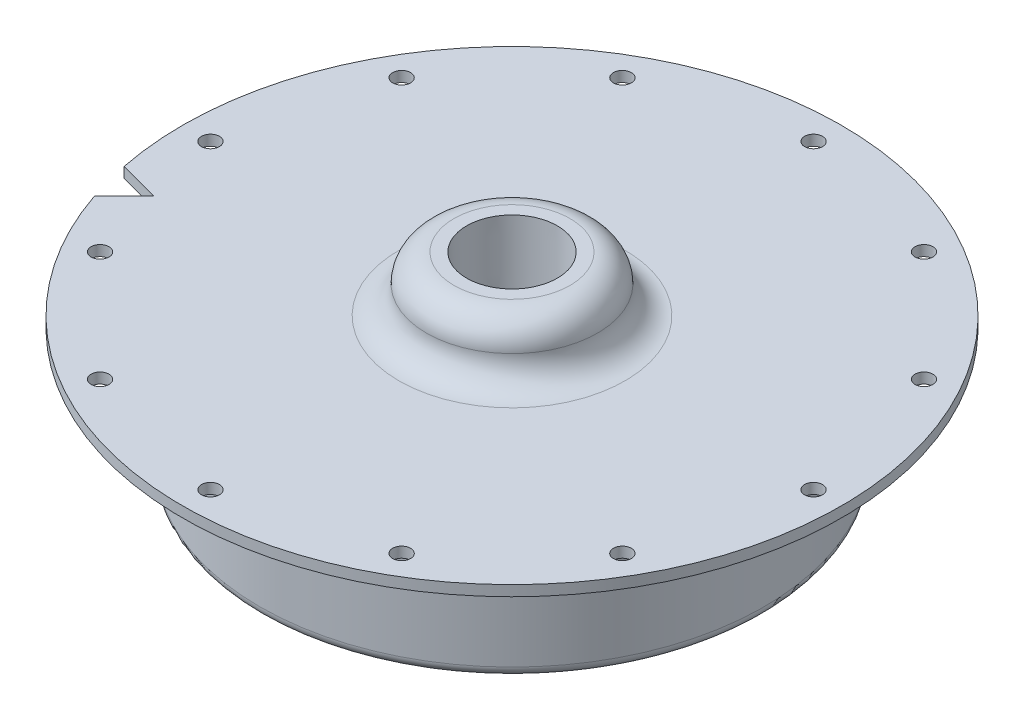
ISO-10303-21;
HEADER;
FILE_DESCRIPTION(('STEP AP214'),'2;1');
FILE_NAME('part.step','',(''),(''),'','','');
FILE_SCHEMA(('AUTOMOTIVE_DESIGN { 1 0 10303 214 1 1 1 1 }'));
ENDSEC;
DATA;
#1=APPLICATION_CONTEXT('core data for automotive mechanical design processes');
#2=APPLICATION_PROTOCOL_DEFINITION('international standard','automotive_design',2000,#1);
#3=PRODUCT_CONTEXT('',#1,'mechanical');
#4=PRODUCT('Part','Part','',(#3));
#5=PRODUCT_RELATED_PRODUCT_CATEGORY('part','',(#4));
#6=PRODUCT_DEFINITION_FORMATION('','',#4);
#7=PRODUCT_DEFINITION_CONTEXT('part definition',#1,'design');
#8=PRODUCT_DEFINITION('design','',#6,#7);
#9=PRODUCT_DEFINITION_SHAPE('','',#8);
#10=(LENGTH_UNIT() NAMED_UNIT(*) SI_UNIT(.MILLI.,.METRE.));
#11=(NAMED_UNIT(*) PLANE_ANGLE_UNIT() SI_UNIT($,.RADIAN.));
#12=(NAMED_UNIT(*) SI_UNIT($,.STERADIAN.) SOLID_ANGLE_UNIT());
#13=UNCERTAINTY_MEASURE_WITH_UNIT(LENGTH_MEASURE(1.E-05),#10,'distance_accuracy_value','');
#14=(GEOMETRIC_REPRESENTATION_CONTEXT(3) GLOBAL_UNCERTAINTY_ASSIGNED_CONTEXT((#13)) GLOBAL_UNIT_ASSIGNED_CONTEXT((#10,
#11,#12)) REPRESENTATION_CONTEXT('',''));
#15=CARTESIAN_POINT('',(0.,0.,0.));
#16=DIRECTION('',(0.,0.,1.));
#17=DIRECTION('',(1.,0.,0.));
#18=AXIS2_PLACEMENT_3D('',#15,#16,#17);
#19=CARTESIAN_POINT('',(0.,55.,0.));
#20=DIRECTION('',(0.,1.,0.));
#21=DIRECTION('',(0.,0.,1.));
#22=AXIS2_PLACEMENT_3D('',#19,#20,#21);
#23=CYLINDRICAL_SURFACE('',#22,49.784);
#24=DIRECTION('',(0.,1.,0.));
#25=VECTOR('',#24,1.);
#26=CARTESIAN_POINT('',(-48.8115083321685,-8.67426131403116,9.79200236614763));
#27=LINE('',#26,#25);
#28=CARTESIAN_POINT('',(-48.8115083321685,0.,9.79200236614763));
#29=VERTEX_POINT('',#28);
#30=CARTESIAN_POINT('',(-48.8115083321685,1.5875,9.79200236614763));
#31=VERTEX_POINT('',#30);
#32=EDGE_CURVE('E66',#29,#31,#27,.T.);
#33=ORIENTED_EDGE('',*,*,#32,.T.);
#34=CARTESIAN_POINT('',(0.,1.5875,0.));
#35=DIRECTION('',(0.,1.,0.));
#36=DIRECTION('',(0.,0.,1.));
#37=AXIS2_PLACEMENT_3D('',#34,#35,#36);
#38=CIRCLE('',#37,49.784);
#39=CARTESIAN_POINT('',(-47.1680073957675,1.5875,15.9256313630832));
#40=VERTEX_POINT('',#39);
#41=EDGE_CURVE('E81',#40,#31,#38,.T.);
#42=ORIENTED_EDGE('',*,*,#41,.F.);
#43=DIRECTION('',(0.,1.,0.));
#44=VECTOR('',#43,1.);
#45=CARTESIAN_POINT('',(-47.1680073957675,-8.67426131403116,15.9256313630832));
#46=LINE('',#45,#44);
#47=CARTESIAN_POINT('',(-47.1680073957675,0.,15.9256313630832));
#48=VERTEX_POINT('',#47);
#49=EDGE_CURVE('E46',#48,#40,#46,.T.);
#50=ORIENTED_EDGE('',*,*,#49,.F.);
#51=CARTESIAN_POINT('',(0.,0.,0.));
#52=DIRECTION('',(0.,1.,0.));
#53=DIRECTION('',(0.,0.,1.));
#54=AXIS2_PLACEMENT_3D('',#51,#52,#53);
#55=CIRCLE('',#54,49.784);
#56=EDGE_CURVE('E11',#48,#29,#55,.T.);
#57=ORIENTED_EDGE('',*,*,#56,.T.);
#58=EDGE_LOOP('',(#33,#42,#50,#57));
#59=FACE_BOUND('',#58,.T.);
#60=ADVANCED_FACE('F32',(#59),#23,.T.);
#61=CARTESIAN_POINT('',(-49.784,0.,0.));
#62=DIRECTION('',(0.,-1.,0.));
#63=DIRECTION('',(0.,0.,-1.));
#64=AXIS2_PLACEMENT_3D('',#61,#62,#63);
#65=PLANE('',#64);
#66=DIRECTION('',(-0.965925826289069,0.,-0.258819045102519));
#67=VECTOR('',#66,1.);
#68=CARTESIAN_POINT('',(-5.71775165127425,0.,21.3389396676165));
#69=LINE('',#68,#67);
#70=CARTESIAN_POINT('',(-42.677879335233,0.,11.4355033025486));
#71=VERTEX_POINT('',#70);
#72=EDGE_CURVE('E64',#71,#29,#69,.T.);
#73=ORIENTED_EDGE('',*,*,#72,.T.);
#74=ORIENTED_EDGE('',*,*,#56,.F.);
#75=DIRECTION('',(0.707106781186548,0.,-0.707106781186547));
#76=VECTOR('',#75,1.);
#77=CARTESIAN_POINT('',(-15.6211880163421,0.,-15.6211880163422));
#78=LINE('',#77,#76);
#79=EDGE_CURVE('E79',#48,#71,#78,.T.);
#80=ORIENTED_EDGE('',*,*,#79,.T.);
#81=EDGE_LOOP('',(#73,#74,#80));
#82=FACE_BOUND('',#81,.T.);
#83=CARTESIAN_POINT('',(-39.4517006668589,0.,-22.7774500000015));
#84=DIRECTION('',(0.,-1.,0.));
#85=DIRECTION('',(0.,0.,-1.));
#86=AXIS2_PLACEMENT_3D('',#83,#84,#85);
#87=CIRCLE('',#86,1.35254999999999);
#88=CARTESIAN_POINT('',(-39.4517006668589,0.,-24.1300000000015));
#89=VERTEX_POINT('',#88);
#90=EDGE_CURVE('E95',#89,#89,#87,.T.);
#91=ORIENTED_EDGE('',*,*,#90,.F.);
#92=EDGE_LOOP('',(#91));
#93=FACE_BOUND('',#92,.T.);
#94=CARTESIAN_POINT('',(-22.7774499999985,0.,-39.4517006668606));
#95=DIRECTION('',(0.,-1.,0.));
#96=DIRECTION('',(0.,0.,-1.));
#97=AXIS2_PLACEMENT_3D('',#94,#95,#96);
#98=CIRCLE('',#97,1.35254999999999);
#99=CARTESIAN_POINT('',(-22.7774499999985,0.,-40.8042506668606));
#100=VERTEX_POINT('',#99);
#101=EDGE_CURVE('E101',#100,#100,#98,.T.);
#102=ORIENTED_EDGE('',*,*,#101,.F.);
#103=EDGE_LOOP('',(#102));
#104=FACE_BOUND('',#103,.T.);
#105=CARTESIAN_POINT('',(1.78252687187594E-12,0.,-45.5549));
#106=DIRECTION('',(0.,-1.,0.));
#107=DIRECTION('',(0.,0.,-1.));
#108=AXIS2_PLACEMENT_3D('',#105,#106,#107);
#109=CIRCLE('',#108,1.35254999999999);
#110=CARTESIAN_POINT('',(1.78252687187594E-12,0.,-46.90745));
#111=VERTEX_POINT('',#110);
#112=EDGE_CURVE('E107',#111,#111,#109,.T.);
#113=ORIENTED_EDGE('',*,*,#112,.F.);
#114=EDGE_LOOP('',(#113));
#115=FACE_BOUND('',#114,.T.);
#116=CARTESIAN_POINT('',(22.7774500000016,0.,-39.4517006668588));
#117=DIRECTION('',(0.,-1.,0.));
#118=DIRECTION('',(0.,0.,-1.));
#119=AXIS2_PLACEMENT_3D('',#116,#117,#118);
#120=CIRCLE('',#119,1.35254999999999);
#121=CARTESIAN_POINT('',(22.7774500000016,0.,-40.8042506668588));
#122=VERTEX_POINT('',#121);
#123=EDGE_CURVE('E113',#122,#122,#120,.T.);
#124=ORIENTED_EDGE('',*,*,#123,.F.);
#125=EDGE_LOOP('',(#124));
#126=FACE_BOUND('',#125,.T.);
#127=CARTESIAN_POINT('',(39.4517006668607,0.,-22.7774499999984));
#128=DIRECTION('',(0.,-1.,0.));
#129=DIRECTION('',(0.,0.,-1.));
#130=AXIS2_PLACEMENT_3D('',#127,#128,#129);
#131=CIRCLE('',#130,1.35254999999999);
#132=CARTESIAN_POINT('',(39.4517006668607,0.,-24.1299999999984));
#133=VERTEX_POINT('',#132);
#134=EDGE_CURVE('E119',#133,#133,#131,.T.);
#135=ORIENTED_EDGE('',*,*,#134,.F.);
#136=EDGE_LOOP('',(#135));
#137=FACE_BOUND('',#136,.T.);
#138=CARTESIAN_POINT('',(45.5549,0.,2.26523184822995E-12));
#139=DIRECTION('',(0.,-1.,0.));
#140=DIRECTION('',(0.,0.,-1.));
#141=AXIS2_PLACEMENT_3D('',#138,#139,#140);
#142=CIRCLE('',#141,1.35254999999999);
#143=CARTESIAN_POINT('',(45.5549,0.,-1.35254999999773));
#144=VERTEX_POINT('',#143);
#145=EDGE_CURVE('E125',#144,#144,#142,.T.);
#146=ORIENTED_EDGE('',*,*,#145,.F.);
#147=EDGE_LOOP('',(#146));
#148=FACE_BOUND('',#147,.T.);
#149=CARTESIAN_POINT('',(39.4517006668587,0.,22.7774500000017));
#150=DIRECTION('',(0.,-1.,0.));
#151=DIRECTION('',(0.,0.,-1.));
#152=AXIS2_PLACEMENT_3D('',#149,#150,#151);
#153=CIRCLE('',#152,1.35254999999999);
#154=CARTESIAN_POINT('',(39.4517006668587,0.,21.4249000000017));
#155=VERTEX_POINT('',#154);
#156=EDGE_CURVE('E131',#155,#155,#153,.T.);
#157=ORIENTED_EDGE('',*,*,#156,.F.);
#158=EDGE_LOOP('',(#157));
#159=FACE_BOUND('',#158,.T.);
#160=CARTESIAN_POINT('',(22.7774499999982,0.,39.4517006668608));
#161=DIRECTION('',(0.,-1.,0.));
#162=DIRECTION('',(0.,0.,-1.));
#163=AXIS2_PLACEMENT_3D('',#160,#161,#162);
#164=CIRCLE('',#163,1.35254999999999);
#165=CARTESIAN_POINT('',(22.7774499999982,0.,38.0991506668608));
#166=VERTEX_POINT('',#165);
#167=EDGE_CURVE('E137',#166,#166,#164,.T.);
#168=ORIENTED_EDGE('',*,*,#167,.F.);
#169=EDGE_LOOP('',(#168));
#170=FACE_BOUND('',#169,.T.);
#171=CARTESIAN_POINT('',(-2.1117204916125E-12,0.,45.5549));
#172=DIRECTION('',(0.,-1.,0.));
#173=DIRECTION('',(0.,0.,-1.));
#174=AXIS2_PLACEMENT_3D('',#171,#172,#173);
#175=CIRCLE('',#174,1.35254999999999);
#176=CARTESIAN_POINT('',(-2.1117204916125E-12,0.,44.20235));
#177=VERTEX_POINT('',#176);
#178=EDGE_CURVE('E143',#177,#177,#175,.T.);
#179=ORIENTED_EDGE('',*,*,#178,.F.);
#180=EDGE_LOOP('',(#179));
#181=FACE_BOUND('',#180,.T.);
#182=CARTESIAN_POINT('',(-22.7774500000019,0.,39.4517006668587));
#183=DIRECTION('',(0.,-1.,0.));
#184=DIRECTION('',(0.,0.,-1.));
#185=AXIS2_PLACEMENT_3D('',#182,#183,#184);
#186=CIRCLE('',#185,1.35254999999999);
#187=CARTESIAN_POINT('',(-22.7774500000019,0.,38.0991506668587));
#188=VERTEX_POINT('',#187);
#189=EDGE_CURVE('E149',#188,#188,#186,.T.);
#190=ORIENTED_EDGE('',*,*,#189,.F.);
#191=EDGE_LOOP('',(#190));
#192=FACE_BOUND('',#191,.T.);
#193=CARTESIAN_POINT('',(-39.4517006668608,0.,22.7774499999981));
#194=DIRECTION('',(0.,-1.,0.));
#195=DIRECTION('',(0.,0.,-1.));
#196=AXIS2_PLACEMENT_3D('',#193,#194,#195);
#197=CIRCLE('',#196,1.35254999999999);
#198=CARTESIAN_POINT('',(-39.4517006668608,0.,21.4248999999981));
#199=VERTEX_POINT('',#198);
#200=EDGE_CURVE('E155',#199,#199,#197,.T.);
#201=ORIENTED_EDGE('',*,*,#200,.F.);
#202=EDGE_LOOP('',(#201));
#203=FACE_BOUND('',#202,.T.);
#204=CARTESIAN_POINT('',(-45.5549,0.,-2.26523184822995E-12));
#205=DIRECTION('',(0.,-1.,0.));
#206=DIRECTION('',(0.,0.,-1.));
#207=AXIS2_PLACEMENT_3D('',#204,#205,#206);
#208=CIRCLE('',#207,1.35254999999999);
#209=CARTESIAN_POINT('',(-45.5549,0.,-1.35255000000226));
#210=VERTEX_POINT('',#209);
#211=EDGE_CURVE('E161',#210,#210,#208,.T.);
#212=ORIENTED_EDGE('',*,*,#211,.F.);
#213=EDGE_LOOP('',(#212));
#214=FACE_BOUND('',#213,.T.);
#215=CARTESIAN_POINT('',(0.,0.,0.));
#216=DIRECTION('',(0.,1.,0.));
#217=DIRECTION('',(0.,0.,1.));
#218=AXIS2_PLACEMENT_3D('',#215,#216,#217);
#219=CIRCLE('',#218,39.6874999999754);
#220=CARTESIAN_POINT('',(0.,0.,39.6874999999754));
#221=VERTEX_POINT('',#220);
#222=EDGE_CURVE('E39',#221,#221,#219,.T.);
#223=ORIENTED_EDGE('',*,*,#222,.T.);
#224=EDGE_LOOP('',(#223));
#225=FACE_BOUND('',#224,.T.);
#226=ADVANCED_FACE('F77',(#82,#93,#104,#115,#126,#137,#148,#159,#170,#181,#192,#203,#214,#225),
#65,.T.);
#227=CARTESIAN_POINT('',(0.,-1.5875,0.));
#228=DIRECTION('',(0.,1.,0.));
#229=DIRECTION('',(0.,0.,1.));
#230=AXIS2_PLACEMENT_3D('',#227,#228,#229);
#231=TOROIDAL_SURFACE('',#230,39.6874999999754,1.5875);
#232=CARTESIAN_POINT('',(0.,-1.5875,0.));
#233=DIRECTION('',(0.,1.,0.));
#234=DIRECTION('',(0.,0.,1.));
#235=AXIS2_PLACEMENT_3D('',#232,#233,#234);
#236=CIRCLE('',#235,38.0999999999754);
#237=CARTESIAN_POINT('',(0.,-1.5875,38.0999999999754));
#238=VERTEX_POINT('',#237);
#239=EDGE_CURVE('E186',#238,#238,#236,.T.);
#240=ORIENTED_EDGE('',*,*,#239,.T.);
#241=EDGE_LOOP('',(#240));
#242=FACE_BOUND('',#241,.T.);
#243=ORIENTED_EDGE('',*,*,#222,.F.);
#244=EDGE_LOOP('',(#243));
#245=FACE_BOUND('',#244,.T.);
#246=ADVANCED_FACE('F192',(#242,#245),#231,.F.);
#247=CARTESIAN_POINT('',(0.,55.,0.));
#248=DIRECTION('',(0.,1.,0.));
#249=DIRECTION('',(0.,0.,1.));
#250=AXIS2_PLACEMENT_3D('',#247,#248,#249);
#251=CYLINDRICAL_SURFACE('',#250,38.0999999999754);
#252=CARTESIAN_POINT('',(0.,-17.4625,0.));
#253=DIRECTION('',(0.,1.,0.));
#254=DIRECTION('',(0.,0.,1.));
#255=AXIS2_PLACEMENT_3D('',#252,#253,#254);
#256=CIRCLE('',#255,38.0999999999754);
#257=CARTESIAN_POINT('',(0.,-17.4625,38.0999999999754));
#258=VERTEX_POINT('',#257);
#259=EDGE_CURVE('E183',#258,#258,#256,.T.);
#260=ORIENTED_EDGE('',*,*,#259,.T.);
#261=EDGE_LOOP('',(#260));
#262=FACE_BOUND('',#261,.T.);
#263=ORIENTED_EDGE('',*,*,#239,.F.);
#264=EDGE_LOOP('',(#263));
#265=FACE_BOUND('',#264,.T.);
#266=ADVANCED_FACE('F194',(#262,#265),#251,.T.);
#267=CARTESIAN_POINT('',(0.,-17.4625,0.));
#268=DIRECTION('',(0.,1.,0.));
#269=DIRECTION('',(0.,0.,1.));
#270=AXIS2_PLACEMENT_3D('',#267,#268,#269);
#271=TOROIDAL_SURFACE('',#270,36.5124999999754,1.5875);
#272=CARTESIAN_POINT('',(0.,-17.4625,0.));
#273=DIRECTION('',(0.,1.,0.));
#274=DIRECTION('',(0.,0.,1.));
#275=AXIS2_PLACEMENT_3D('',#272,#273,#274);
#276=CIRCLE('',#275,34.9249999999754);
#277=CARTESIAN_POINT('',(0.,-17.4625,34.9249999999754));
#278=VERTEX_POINT('',#277);
#279=EDGE_CURVE('E180',#278,#278,#276,.T.);
#280=ORIENTED_EDGE('',*,*,#279,.T.);
#281=EDGE_LOOP('',(#280));
#282=FACE_BOUND('',#281,.T.);
#283=ORIENTED_EDGE('',*,*,#259,.F.);
#284=EDGE_LOOP('',(#283));
#285=FACE_BOUND('',#284,.T.);
#286=ADVANCED_FACE('F201',(#282,#285),#271,.T.);
#287=CARTESIAN_POINT('',(0.,55.,0.));
#288=DIRECTION('',(0.,1.,0.));
#289=DIRECTION('',(0.,0.,1.));
#290=AXIS2_PLACEMENT_3D('',#287,#288,#289);
#291=CYLINDRICAL_SURFACE('',#290,34.9249999999754);
#292=CARTESIAN_POINT('',(0.,-3.175,0.));
#293=DIRECTION('',(0.,1.,0.));
#294=DIRECTION('',(0.,0.,1.));
#295=AXIS2_PLACEMENT_3D('',#292,#293,#294);
#296=CIRCLE('',#295,34.9249999999754);
#297=CARTESIAN_POINT('',(0.,-3.175,34.9249999999754));
#298=VERTEX_POINT('',#297);
#299=EDGE_CURVE('E177',#298,#298,#296,.T.);
#300=ORIENTED_EDGE('',*,*,#299,.T.);
#301=EDGE_LOOP('',(#300));
#302=FACE_BOUND('',#301,.T.);
#303=ORIENTED_EDGE('',*,*,#279,.F.);
#304=EDGE_LOOP('',(#303));
#305=FACE_BOUND('',#304,.T.);
#306=ADVANCED_FACE('F319',(#302,#305),#291,.F.);
#307=CARTESIAN_POINT('',(0.,-3.175,0.));
#308=DIRECTION('',(0.,1.,0.));
#309=DIRECTION('',(0.,0.,1.));
#310=AXIS2_PLACEMENT_3D('',#307,#308,#309);
#311=TOROIDAL_SURFACE('',#310,31.7499999999754,3.17499999999999);
#312=CARTESIAN_POINT('',(0.,0.,0.));
#313=DIRECTION('',(0.,1.,0.));
#314=DIRECTION('',(0.,0.,1.));
#315=AXIS2_PLACEMENT_3D('',#312,#313,#314);
#316=CIRCLE('',#315,31.7499999999754);
#317=CARTESIAN_POINT('',(0.,0.,31.7499999999754));
#318=VERTEX_POINT('',#317);
#319=EDGE_CURVE('E174',#318,#318,#316,.T.);
#320=ORIENTED_EDGE('',*,*,#319,.T.);
#321=EDGE_LOOP('',(#320));
#322=FACE_BOUND('',#321,.T.);
#323=ORIENTED_EDGE('',*,*,#299,.F.);
#324=EDGE_LOOP('',(#323));
#325=FACE_BOUND('',#324,.T.);
#326=ADVANCED_FACE('F315',(#322,#325),#311,.F.);
#327=CARTESIAN_POINT('',(-31.7499999999754,0.,0.));
#328=DIRECTION('',(0.,-1.,0.));
#329=DIRECTION('',(0.,0.,-1.));
#330=AXIS2_PLACEMENT_3D('',#327,#328,#329);
#331=PLANE('',#330);
#332=CARTESIAN_POINT('',(0.,0.,0.));
#333=DIRECTION('',(0.,1.,0.));
#334=DIRECTION('',(0.,0.,1.));
#335=AXIS2_PLACEMENT_3D('',#332,#333,#334);
#336=CIRCLE('',#335,6.55798479417671);
#337=CARTESIAN_POINT('',(0.,0.,6.55798479417671));
#338=VERTEX_POINT('',#337);
#339=EDGE_CURVE('E89',#338,#338,#336,.T.);
#340=ORIENTED_EDGE('',*,*,#339,.T.);
#341=EDGE_LOOP('',(#340));
#342=FACE_BOUND('',#341,.T.);
#343=ORIENTED_EDGE('',*,*,#319,.F.);
#344=EDGE_LOOP('',(#343));
#345=FACE_BOUND('',#344,.T.);
#346=ADVANCED_FACE('F311',(#342,#345),#331,.T.);
#347=CARTESIAN_POINT('',(-5.588,9.906,0.));
#348=DIRECTION('',(0.,1.,0.));
#349=DIRECTION('',(0.,0.,1.));
#350=AXIS2_PLACEMENT_3D('',#347,#348,#349);
#351=PLANE('',#350);
#352=CARTESIAN_POINT('',(0.,9.906,0.));
#353=DIRECTION('',(0.,1.,0.));
#354=DIRECTION('',(0.,0.,1.));
#355=AXIS2_PLACEMENT_3D('',#352,#353,#354);
#356=CIRCLE('',#355,6.8545837);
#357=CARTESIAN_POINT('',(0.,9.906,6.8545837));
#358=VERTEX_POINT('',#357);
#359=EDGE_CURVE('E86',#358,#358,#356,.T.);
#360=ORIENTED_EDGE('',*,*,#359,.F.);
#361=EDGE_LOOP('',(#360));
#362=FACE_BOUND('',#361,.T.);
#363=CARTESIAN_POINT('',(0.,9.906,0.));
#364=DIRECTION('',(0.,1.,0.));
#365=DIRECTION('',(0.,0.,1.));
#366=AXIS2_PLACEMENT_3D('',#363,#364,#365);
#367=CIRCLE('',#366,8.763);
#368=CARTESIAN_POINT('',(0.,9.906,8.763));
#369=VERTEX_POINT('',#368);
#370=EDGE_CURVE('E171',#369,#369,#367,.T.);
#371=ORIENTED_EDGE('',*,*,#370,.T.);
#372=EDGE_LOOP('',(#371));
#373=FACE_BOUND('',#372,.T.);
#374=ADVANCED_FACE('F307',(#362,#373),#351,.T.);
#375=CARTESIAN_POINT('',(0.,5.74675,0.));
#376=DIRECTION('',(0.,1.,0.));
#377=DIRECTION('',(0.,0.,1.));
#378=AXIS2_PLACEMENT_3D('',#375,#376,#377);
#379=TOROIDAL_SURFACE('',#378,8.763,4.15925);
#380=CARTESIAN_POINT('',(0.,5.74675,0.));
#381=DIRECTION('',(0.,1.,0.));
#382=DIRECTION('',(0.,0.,1.));
#383=AXIS2_PLACEMENT_3D('',#380,#381,#382);
#384=CIRCLE('',#383,12.92225);
#385=CARTESIAN_POINT('',(0.,5.74675,12.92225));
#386=VERTEX_POINT('',#385);
#387=EDGE_CURVE('E168',#386,#386,#384,.T.);
#388=ORIENTED_EDGE('',*,*,#387,.T.);
#389=EDGE_LOOP('',(#388));
#390=FACE_BOUND('',#389,.T.);
#391=ORIENTED_EDGE('',*,*,#370,.F.);
#392=EDGE_LOOP('',(#391));
#393=FACE_BOUND('',#392,.T.);
#394=ADVANCED_FACE('F303',(#390,#393),#379,.T.);
#395=CARTESIAN_POINT('',(0.,5.74675,0.));
#396=DIRECTION('',(0.,1.,0.));
#397=DIRECTION('',(0.,0.,1.));
#398=AXIS2_PLACEMENT_3D('',#395,#396,#397);
#399=TOROIDAL_SURFACE('',#398,17.0815,4.15925);
#400=CARTESIAN_POINT('',(0.,1.5875,0.));
#401=DIRECTION('',(0.,1.,0.));
#402=DIRECTION('',(0.,0.,1.));
#403=AXIS2_PLACEMENT_3D('',#400,#401,#402);
#404=CIRCLE('',#403,17.0815);
#405=CARTESIAN_POINT('',(0.,1.5875,17.0815));
#406=VERTEX_POINT('',#405);
#407=EDGE_CURVE('E165',#406,#406,#404,.T.);
#408=ORIENTED_EDGE('',*,*,#407,.T.);
#409=EDGE_LOOP('',(#408));
#410=FACE_BOUND('',#409,.T.);
#411=ORIENTED_EDGE('',*,*,#387,.F.);
#412=EDGE_LOOP('',(#411));
#413=FACE_BOUND('',#412,.T.);
#414=ADVANCED_FACE('F224',(#410,#413),#399,.F.);
#415=CARTESIAN_POINT('',(-49.784,1.5875,0.));
#416=DIRECTION('',(0.,1.,0.));
#417=DIRECTION('',(0.,0.,1.));
#418=AXIS2_PLACEMENT_3D('',#415,#416,#417);
#419=PLANE('',#418);
#420=DIRECTION('',(-0.965925826289069,0.,-0.258819045102519));
#421=VECTOR('',#420,1.);
#422=CARTESIAN_POINT('',(-5.71775165127425,1.5875,21.3389396676165));
#423=LINE('',#422,#421);
#424=CARTESIAN_POINT('',(-42.677879335233,1.5875,11.4355033025486));
#425=VERTEX_POINT('',#424);
#426=EDGE_CURVE('E69',#425,#31,#423,.T.);
#427=ORIENTED_EDGE('',*,*,#426,.F.);
#428=DIRECTION('',(0.707106781186548,0.,-0.707106781186547));
#429=VECTOR('',#428,1.);
#430=CARTESIAN_POINT('',(-15.6211880163421,1.5875,-15.6211880163422));
#431=LINE('',#430,#429);
#432=EDGE_CURVE('E530',#40,#425,#431,.T.);
#433=ORIENTED_EDGE('',*,*,#432,.F.);
#434=ORIENTED_EDGE('',*,*,#41,.T.);
#435=EDGE_LOOP('',(#427,#433,#434));
#436=FACE_BOUND('',#435,.T.);
#437=CARTESIAN_POINT('',(-39.4517006668589,1.58750000000002,-22.7774500000015));
#438=DIRECTION('',(0.,1.,0.));
#439=DIRECTION('',(0.,0.,1.));
#440=AXIS2_PLACEMENT_3D('',#437,#438,#439);
#441=CIRCLE('',#440,1.35254999999999);
#442=CARTESIAN_POINT('',(-39.4517006668589,1.58750000000002,-21.4249000000015));
#443=VERTEX_POINT('',#442);
#444=EDGE_CURVE('E92',#443,#443,#441,.T.);
#445=ORIENTED_EDGE('',*,*,#444,.F.);
#446=EDGE_LOOP('',(#445));
#447=FACE_BOUND('',#446,.T.);
#448=CARTESIAN_POINT('',(-22.7774499999985,1.58750000000008,-39.4517006668606));
#449=DIRECTION('',(0.,1.,0.));
#450=DIRECTION('',(0.,0.,1.));
#451=AXIS2_PLACEMENT_3D('',#448,#449,#450);
#452=CIRCLE('',#451,1.35254999999999);
#453=CARTESIAN_POINT('',(-22.7774499999985,1.58750000000008,-38.0991506668606));
#454=VERTEX_POINT('',#453);
#455=EDGE_CURVE('E98',#454,#454,#452,.T.);
#456=ORIENTED_EDGE('',*,*,#455,.F.);
#457=EDGE_LOOP('',(#456));
#458=FACE_BOUND('',#457,.T.);
#459=CARTESIAN_POINT('',(1.78252687187594E-12,1.58750000000016,-45.5549));
#460=DIRECTION('',(0.,1.,0.));
#461=DIRECTION('',(0.,0.,1.));
#462=AXIS2_PLACEMENT_3D('',#459,#460,#461);
#463=CIRCLE('',#462,1.35254999999999);
#464=CARTESIAN_POINT('',(1.78252687187594E-12,1.58750000000016,-44.20235));
#465=VERTEX_POINT('',#464);
#466=EDGE_CURVE('E104',#465,#465,#463,.T.);
#467=ORIENTED_EDGE('',*,*,#466,.F.);
#468=EDGE_LOOP('',(#467));
#469=FACE_BOUND('',#468,.T.);
#470=CARTESIAN_POINT('',(22.7774500000016,1.58750000000024,-39.4517006668588));
#471=DIRECTION('',(0.,1.,0.));
#472=DIRECTION('',(0.,0.,1.));
#473=AXIS2_PLACEMENT_3D('',#470,#471,#472);
#474=CIRCLE('',#473,1.35254999999999);
#475=CARTESIAN_POINT('',(22.7774500000016,1.58750000000024,-38.0991506668588));
#476=VERTEX_POINT('',#475);
#477=EDGE_CURVE('E110',#476,#476,#474,.T.);
#478=ORIENTED_EDGE('',*,*,#477,.F.);
#479=EDGE_LOOP('',(#478));
#480=FACE_BOUND('',#479,.T.);
#481=CARTESIAN_POINT('',(39.4517006668607,1.5875000000003,-22.7774499999984));
#482=DIRECTION('',(0.,1.,0.));
#483=DIRECTION('',(0.,0.,1.));
#484=AXIS2_PLACEMENT_3D('',#481,#482,#483);
#485=CIRCLE('',#484,1.35254999999999);
#486=CARTESIAN_POINT('',(39.4517006668607,1.5875000000003,-21.4248999999984));
#487=VERTEX_POINT('',#486);
#488=EDGE_CURVE('E116',#487,#487,#485,.T.);
#489=ORIENTED_EDGE('',*,*,#488,.F.);
#490=EDGE_LOOP('',(#489));
#491=FACE_BOUND('',#490,.T.);
#492=CARTESIAN_POINT('',(45.5549,1.58750000000032,2.26523184822995E-12));
#493=DIRECTION('',(0.,1.,0.));
#494=DIRECTION('',(0.,0.,1.));
#495=AXIS2_PLACEMENT_3D('',#492,#493,#494);
#496=CIRCLE('',#495,1.35254999999999);
#497=CARTESIAN_POINT('',(45.5549,1.58750000000032,1.35255000000225));
#498=VERTEX_POINT('',#497);
#499=EDGE_CURVE('E122',#498,#498,#496,.T.);
#500=ORIENTED_EDGE('',*,*,#499,.F.);
#501=EDGE_LOOP('',(#500));
#502=FACE_BOUND('',#501,.T.);
#503=CARTESIAN_POINT('',(39.4517006668587,1.5875000000003,22.7774500000017));
#504=DIRECTION('',(0.,1.,0.));
#505=DIRECTION('',(0.,0.,1.));
#506=AXIS2_PLACEMENT_3D('',#503,#504,#505);
#507=CIRCLE('',#506,1.35254999999999);
#508=CARTESIAN_POINT('',(39.4517006668587,1.5875000000003,24.1300000000017));
#509=VERTEX_POINT('',#508);
#510=EDGE_CURVE('E128',#509,#509,#507,.T.);
#511=ORIENTED_EDGE('',*,*,#510,.F.);
#512=EDGE_LOOP('',(#511));
#513=FACE_BOUND('',#512,.T.);
#514=CARTESIAN_POINT('',(22.7774499999982,1.58750000000024,39.4517006668608));
#515=DIRECTION('',(0.,1.,0.));
#516=DIRECTION('',(0.,0.,1.));
#517=AXIS2_PLACEMENT_3D('',#514,#515,#516);
#518=CIRCLE('',#517,1.35254999999999);
#519=CARTESIAN_POINT('',(22.7774499999982,1.58750000000024,40.8042506668608));
#520=VERTEX_POINT('',#519);
#521=EDGE_CURVE('E134',#520,#520,#518,.T.);
#522=ORIENTED_EDGE('',*,*,#521,.F.);
#523=EDGE_LOOP('',(#522));
#524=FACE_BOUND('',#523,.T.);
#525=CARTESIAN_POINT('',(-2.1117204916125E-12,1.58750000000016,45.5549));
#526=DIRECTION('',(0.,1.,0.));
#527=DIRECTION('',(0.,0.,1.));
#528=AXIS2_PLACEMENT_3D('',#525,#526,#527);
#529=CIRCLE('',#528,1.35254999999999);
#530=CARTESIAN_POINT('',(-2.1117204916125E-12,1.58750000000016,46.90745));
#531=VERTEX_POINT('',#530);
#532=EDGE_CURVE('E140',#531,#531,#529,.T.);
#533=ORIENTED_EDGE('',*,*,#532,.F.);
#534=EDGE_LOOP('',(#533));
#535=FACE_BOUND('',#534,.T.);
#536=CARTESIAN_POINT('',(-22.7774500000019,1.58750000000008,39.4517006668586));
#537=DIRECTION('',(0.,1.,0.));
#538=DIRECTION('',(0.,0.,1.));
#539=AXIS2_PLACEMENT_3D('',#536,#537,#538);
#540=CIRCLE('',#539,1.35254999999999);
#541=CARTESIAN_POINT('',(-22.7774500000019,1.58750000000008,40.8042506668586));
#542=VERTEX_POINT('',#541);
#543=EDGE_CURVE('E146',#542,#542,#540,.T.);
#544=ORIENTED_EDGE('',*,*,#543,.F.);
#545=EDGE_LOOP('',(#544));
#546=FACE_BOUND('',#545,.T.);
#547=CARTESIAN_POINT('',(-39.4517006668608,1.58750000000002,22.7774499999981));
#548=DIRECTION('',(0.,1.,0.));
#549=DIRECTION('',(0.,0.,1.));
#550=AXIS2_PLACEMENT_3D('',#547,#548,#549);
#551=CIRCLE('',#550,1.35254999999999);
#552=CARTESIAN_POINT('',(-39.4517006668608,1.58750000000002,24.1299999999981));
#553=VERTEX_POINT('',#552);
#554=EDGE_CURVE('E152',#553,#553,#551,.T.);
#555=ORIENTED_EDGE('',*,*,#554,.F.);
#556=EDGE_LOOP('',(#555));
#557=FACE_BOUND('',#556,.T.);
#558=CARTESIAN_POINT('',(-45.5549,1.5875,-2.26523184822995E-12));
#559=DIRECTION('',(0.,1.,0.));
#560=DIRECTION('',(0.,0.,1.));
#561=AXIS2_PLACEMENT_3D('',#558,#559,#560);
#562=CIRCLE('',#561,1.35254999999999);
#563=CARTESIAN_POINT('',(-45.5549,1.5875,1.35254999999772));
#564=VERTEX_POINT('',#563);
#565=EDGE_CURVE('E158',#564,#564,#562,.T.);
#566=ORIENTED_EDGE('',*,*,#565,.F.);
#567=EDGE_LOOP('',(#566));
#568=FACE_BOUND('',#567,.T.);
#569=ORIENTED_EDGE('',*,*,#407,.F.);
#570=EDGE_LOOP('',(#569));
#571=FACE_BOUND('',#570,.T.);
#572=ADVANCED_FACE('F218',(#436,#447,#458,#469,#480,#491,#502,#513,#524,#535,#546,#557,#568,
#571),#419,.T.);
#573=CARTESIAN_POINT('',(-45.5549,1.5875,-2.26523184822995E-12));
#574=DIRECTION('',(0.,1.,0.));
#575=DIRECTION('',(0.,0.,1.));
#576=AXIS2_PLACEMENT_3D('',#573,#574,#575);
#577=CYLINDRICAL_SURFACE('',#576,1.35254999999999);
#578=ORIENTED_EDGE('',*,*,#211,.T.);
#579=EDGE_LOOP('',(#578));
#580=FACE_BOUND('',#579,.T.);
#581=ORIENTED_EDGE('',*,*,#565,.T.);
#582=EDGE_LOOP('',(#581));
#583=FACE_BOUND('',#582,.T.);
#584=ADVANCED_FACE('F223',(#580,#583),#577,.F.);
#585=CARTESIAN_POINT('',(-39.4517006668608,1.58750000000002,22.7774499999981));
#586=DIRECTION('',(0.,1.,0.));
#587=DIRECTION('',(0.,0.,1.));
#588=AXIS2_PLACEMENT_3D('',#585,#586,#587);
#589=CYLINDRICAL_SURFACE('',#588,1.35254999999999);
#590=ORIENTED_EDGE('',*,*,#200,.T.);
#591=EDGE_LOOP('',(#590));
#592=FACE_BOUND('',#591,.T.);
#593=ORIENTED_EDGE('',*,*,#554,.T.);
#594=EDGE_LOOP('',(#593));
#595=FACE_BOUND('',#594,.T.);
#596=ADVANCED_FACE('F295',(#592,#595),#589,.F.);
#597=CARTESIAN_POINT('',(-22.7774500000019,1.58750000000008,39.4517006668586));
#598=DIRECTION('',(0.,1.,0.));
#599=DIRECTION('',(0.,0.,1.));
#600=AXIS2_PLACEMENT_3D('',#597,#598,#599);
#601=CYLINDRICAL_SURFACE('',#600,1.35254999999999);
#602=ORIENTED_EDGE('',*,*,#189,.T.);
#603=EDGE_LOOP('',(#602));
#604=FACE_BOUND('',#603,.T.);
#605=ORIENTED_EDGE('',*,*,#543,.T.);
#606=EDGE_LOOP('',(#605));
#607=FACE_BOUND('',#606,.T.);
#608=ADVANCED_FACE('F291',(#604,#607),#601,.F.);
#609=CARTESIAN_POINT('',(-2.1117204916125E-12,1.58750000000016,45.5549));
#610=DIRECTION('',(0.,1.,0.));
#611=DIRECTION('',(0.,0.,1.));
#612=AXIS2_PLACEMENT_3D('',#609,#610,#611);
#613=CYLINDRICAL_SURFACE('',#612,1.35254999999999);
#614=ORIENTED_EDGE('',*,*,#178,.T.);
#615=EDGE_LOOP('',(#614));
#616=FACE_BOUND('',#615,.T.);
#617=ORIENTED_EDGE('',*,*,#532,.T.);
#618=EDGE_LOOP('',(#617));
#619=FACE_BOUND('',#618,.T.);
#620=ADVANCED_FACE('F287',(#616,#619),#613,.F.);
#621=CARTESIAN_POINT('',(22.7774499999982,1.58750000000024,39.4517006668608));
#622=DIRECTION('',(0.,1.,0.));
#623=DIRECTION('',(0.,0.,1.));
#624=AXIS2_PLACEMENT_3D('',#621,#622,#623);
#625=CYLINDRICAL_SURFACE('',#624,1.35254999999999);
#626=ORIENTED_EDGE('',*,*,#167,.T.);
#627=EDGE_LOOP('',(#626));
#628=FACE_BOUND('',#627,.T.);
#629=ORIENTED_EDGE('',*,*,#521,.T.);
#630=EDGE_LOOP('',(#629));
#631=FACE_BOUND('',#630,.T.);
#632=ADVANCED_FACE('F283',(#628,#631),#625,.F.);
#633=CARTESIAN_POINT('',(39.4517006668587,1.5875000000003,22.7774500000017));
#634=DIRECTION('',(0.,1.,0.));
#635=DIRECTION('',(0.,0.,1.));
#636=AXIS2_PLACEMENT_3D('',#633,#634,#635);
#637=CYLINDRICAL_SURFACE('',#636,1.35254999999999);
#638=ORIENTED_EDGE('',*,*,#156,.T.);
#639=EDGE_LOOP('',(#638));
#640=FACE_BOUND('',#639,.T.);
#641=ORIENTED_EDGE('',*,*,#510,.T.);
#642=EDGE_LOOP('',(#641));
#643=FACE_BOUND('',#642,.T.);
#644=ADVANCED_FACE('F279',(#640,#643),#637,.F.);
#645=CARTESIAN_POINT('',(45.5549,1.58750000000032,2.26523184822995E-12));
#646=DIRECTION('',(0.,1.,0.));
#647=DIRECTION('',(0.,0.,1.));
#648=AXIS2_PLACEMENT_3D('',#645,#646,#647);
#649=CYLINDRICAL_SURFACE('',#648,1.35254999999999);
#650=ORIENTED_EDGE('',*,*,#145,.T.);
#651=EDGE_LOOP('',(#650));
#652=FACE_BOUND('',#651,.T.);
#653=ORIENTED_EDGE('',*,*,#499,.T.);
#654=EDGE_LOOP('',(#653));
#655=FACE_BOUND('',#654,.T.);
#656=ADVANCED_FACE('F275',(#652,#655),#649,.F.);
#657=CARTESIAN_POINT('',(39.4517006668607,1.5875000000003,-22.7774499999984));
#658=DIRECTION('',(0.,1.,0.));
#659=DIRECTION('',(0.,0.,1.));
#660=AXIS2_PLACEMENT_3D('',#657,#658,#659);
#661=CYLINDRICAL_SURFACE('',#660,1.35254999999999);
#662=ORIENTED_EDGE('',*,*,#134,.T.);
#663=EDGE_LOOP('',(#662));
#664=FACE_BOUND('',#663,.T.);
#665=ORIENTED_EDGE('',*,*,#488,.T.);
#666=EDGE_LOOP('',(#665));
#667=FACE_BOUND('',#666,.T.);
#668=ADVANCED_FACE('F271',(#664,#667),#661,.F.);
#669=CARTESIAN_POINT('',(22.7774500000016,1.58750000000024,-39.4517006668588));
#670=DIRECTION('',(0.,1.,0.));
#671=DIRECTION('',(0.,0.,1.));
#672=AXIS2_PLACEMENT_3D('',#669,#670,#671);
#673=CYLINDRICAL_SURFACE('',#672,1.35254999999999);
#674=ORIENTED_EDGE('',*,*,#123,.T.);
#675=EDGE_LOOP('',(#674));
#676=FACE_BOUND('',#675,.T.);
#677=ORIENTED_EDGE('',*,*,#477,.T.);
#678=EDGE_LOOP('',(#677));
#679=FACE_BOUND('',#678,.T.);
#680=ADVANCED_FACE('F267',(#676,#679),#673,.F.);
#681=CARTESIAN_POINT('',(1.78252687187594E-12,1.58750000000016,-45.5549));
#682=DIRECTION('',(0.,1.,0.));
#683=DIRECTION('',(0.,0.,1.));
#684=AXIS2_PLACEMENT_3D('',#681,#682,#683);
#685=CYLINDRICAL_SURFACE('',#684,1.35254999999999);
#686=ORIENTED_EDGE('',*,*,#112,.T.);
#687=EDGE_LOOP('',(#686));
#688=FACE_BOUND('',#687,.T.);
#689=ORIENTED_EDGE('',*,*,#466,.T.);
#690=EDGE_LOOP('',(#689));
#691=FACE_BOUND('',#690,.T.);
#692=ADVANCED_FACE('F263',(#688,#691),#685,.F.);
#693=CARTESIAN_POINT('',(-22.7774499999985,1.58750000000008,-39.4517006668606));
#694=DIRECTION('',(0.,1.,0.));
#695=DIRECTION('',(0.,0.,1.));
#696=AXIS2_PLACEMENT_3D('',#693,#694,#695);
#697=CYLINDRICAL_SURFACE('',#696,1.35254999999999);
#698=ORIENTED_EDGE('',*,*,#101,.T.);
#699=EDGE_LOOP('',(#698));
#700=FACE_BOUND('',#699,.T.);
#701=ORIENTED_EDGE('',*,*,#455,.T.);
#702=EDGE_LOOP('',(#701));
#703=FACE_BOUND('',#702,.T.);
#704=ADVANCED_FACE('F259',(#700,#703),#697,.F.);
#705=CARTESIAN_POINT('',(-39.4517006668589,1.58750000000002,-22.7774500000015));
#706=DIRECTION('',(0.,1.,0.));
#707=DIRECTION('',(0.,0.,1.));
#708=AXIS2_PLACEMENT_3D('',#705,#706,#707);
#709=CYLINDRICAL_SURFACE('',#708,1.35254999999999);
#710=ORIENTED_EDGE('',*,*,#90,.T.);
#711=EDGE_LOOP('',(#710));
#712=FACE_BOUND('',#711,.T.);
#713=ORIENTED_EDGE('',*,*,#444,.T.);
#714=EDGE_LOOP('',(#713));
#715=FACE_BOUND('',#714,.T.);
#716=ADVANCED_FACE('F255',(#712,#715),#709,.F.);
#717=CARTESIAN_POINT('',(0.,9.906,0.));
#718=DIRECTION('',(0.,1.,0.));
#719=DIRECTION('',(0.,0.,1.));
#720=AXIS2_PLACEMENT_3D('',#717,#718,#719);
#721=CONICAL_SURFACE('',#720,6.8545837,0.029932396671703);
#722=ORIENTED_EDGE('',*,*,#339,.F.);
#723=EDGE_LOOP('',(#722));
#724=FACE_BOUND('',#723,.T.);
#725=ORIENTED_EDGE('',*,*,#359,.T.);
#726=EDGE_LOOP('',(#725));
#727=FACE_BOUND('',#726,.T.);
#728=ADVANCED_FACE('F239',(#724,#727),#721,.F.);
#729=CARTESIAN_POINT('',(-5.71775165127425,-8.67426131403116,21.3389396676165));
#730=DIRECTION('',(0.258819045102519,0.,-0.965925826289069));
#731=DIRECTION('',(-0.965925826289069,0.,-0.258819045102519));
#732=AXIS2_PLACEMENT_3D('',#729,#730,#731);
#733=PLANE('',#732);
#734=DIRECTION('',(0.,1.,0.));
#735=VECTOR('',#734,1.);
#736=CARTESIAN_POINT('',(-42.677879335233,-8.67426131403116,11.4355033025486));
#737=LINE('',#736,#735);
#738=EDGE_CURVE('E55',#71,#425,#737,.T.);
#739=ORIENTED_EDGE('',*,*,#738,.T.);
#740=ORIENTED_EDGE('',*,*,#426,.T.);
#741=ORIENTED_EDGE('',*,*,#32,.F.);
#742=ORIENTED_EDGE('',*,*,#72,.F.);
#743=EDGE_LOOP('',(#739,#740,#741,#742));
#744=FACE_BOUND('',#743,.T.);
#745=ADVANCED_FACE('F67',(#744),#733,.F.);
#746=CARTESIAN_POINT('',(-15.6211880163421,-8.67426131403116,-15.6211880163422));
#747=DIRECTION('',(0.707106781186547,0.,0.707106781186548));
#748=DIRECTION('',(0.707106781186548,0.,-0.707106781186547));
#749=AXIS2_PLACEMENT_3D('',#746,#747,#748);
#750=PLANE('',#749);
#751=ORIENTED_EDGE('',*,*,#49,.T.);
#752=ORIENTED_EDGE('',*,*,#432,.T.);
#753=ORIENTED_EDGE('',*,*,#738,.F.);
#754=ORIENTED_EDGE('',*,*,#79,.F.);
#755=EDGE_LOOP('',(#751,#752,#753,#754));
#756=FACE_BOUND('',#755,.T.);
#757=ADVANCED_FACE('F238',(#756),#750,.F.);
#758=CLOSED_SHELL('',(#60,#226,#246,#266,#286,#306,#326,#346,#374,#394,#414,#572,#584,#596,#608,
#620,#632,#644,#656,#668,#680,#692,#704,#716,#728,#745,#757));
#759=MANIFOLD_SOLID_BREP('B2',#758);
#760=ADVANCED_BREP_SHAPE_REPRESENTATION('',(#18,#759),#14);
#761=SHAPE_DEFINITION_REPRESENTATION(#9,#760);
ENDSEC;
END-ISO-10303-21;
